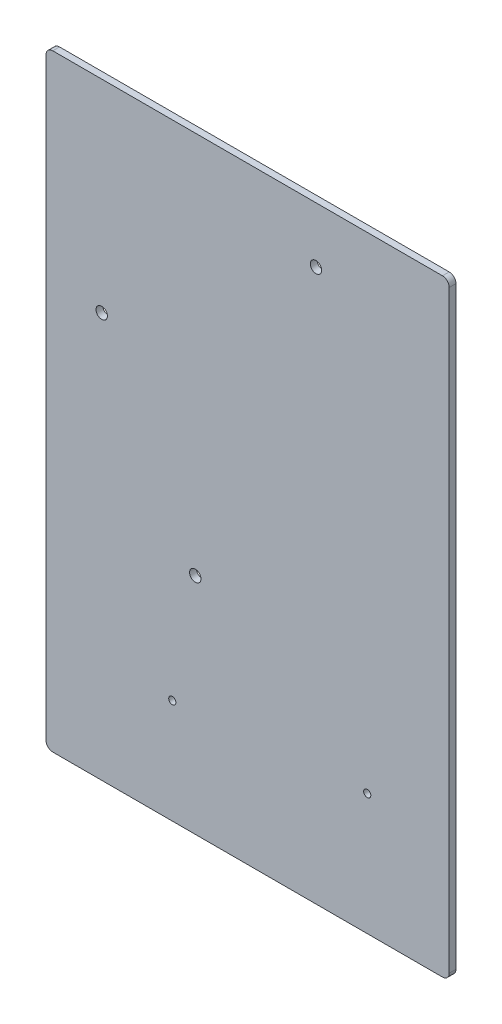
ISO-10303-21;
HEADER;
FILE_DESCRIPTION(('STEP AP214'),'2;1');
FILE_NAME('part.step','',(''),(''),'','','');
FILE_SCHEMA(('AUTOMOTIVE_DESIGN { 1 0 10303 214 1 1 1 1 }'));
ENDSEC;
DATA;
#1=APPLICATION_CONTEXT('core data for automotive mechanical design processes');
#2=APPLICATION_PROTOCOL_DEFINITION('international standard','automotive_design',2000,#1);
#3=PRODUCT_CONTEXT('',#1,'mechanical');
#4=PRODUCT('Part','Part','',(#3));
#5=PRODUCT_RELATED_PRODUCT_CATEGORY('part','',(#4));
#6=PRODUCT_DEFINITION_FORMATION('','',#4);
#7=PRODUCT_DEFINITION_CONTEXT('part definition',#1,'design');
#8=PRODUCT_DEFINITION('design','',#6,#7);
#9=PRODUCT_DEFINITION_SHAPE('','',#8);
#10=(LENGTH_UNIT() NAMED_UNIT(*) SI_UNIT(.MILLI.,.METRE.));
#11=(NAMED_UNIT(*) PLANE_ANGLE_UNIT() SI_UNIT($,.RADIAN.));
#12=(NAMED_UNIT(*) SI_UNIT($,.STERADIAN.) SOLID_ANGLE_UNIT());
#13=UNCERTAINTY_MEASURE_WITH_UNIT(LENGTH_MEASURE(1.E-05),#10,'distance_accuracy_value','');
#14=(GEOMETRIC_REPRESENTATION_CONTEXT(3) GLOBAL_UNCERTAINTY_ASSIGNED_CONTEXT((#13)) GLOBAL_UNIT_ASSIGNED_CONTEXT((#10,
#11,#12)) REPRESENTATION_CONTEXT('',''));
#15=CARTESIAN_POINT('',(0.,0.,0.));
#16=DIRECTION('',(0.,0.,1.));
#17=DIRECTION('',(1.,0.,0.));
#18=AXIS2_PLACEMENT_3D('',#15,#16,#17);
#19=CARTESIAN_POINT('',(0.,0.,6.35));
#20=DIRECTION('',(0.,1.,0.));
#21=DIRECTION('',(0.,0.,1.));
#22=AXIS2_PLACEMENT_3D('',#19,#20,#21);
#23=PLANE('',#22);
#24=DIRECTION('',(1.,0.,0.));
#25=VECTOR('',#24,1.);
#26=CARTESIAN_POINT('',(0.,0.,0.));
#27=LINE('',#26,#25);
#28=CARTESIAN_POINT('',(6.35,0.,0.));
#29=VERTEX_POINT('',#28);
#30=CARTESIAN_POINT('',(373.0625,0.,0.));
#31=VERTEX_POINT('',#30);
#32=EDGE_CURVE('E188',#29,#31,#27,.T.);
#33=ORIENTED_EDGE('',*,*,#32,.T.);
#34=DIRECTION('',(0.,0.,-1.));
#35=VECTOR('',#34,1.);
#36=CARTESIAN_POINT('',(373.0625,0.,6.35));
#37=LINE('',#36,#35);
#38=CARTESIAN_POINT('',(373.0625,0.,6.35));
#39=VERTEX_POINT('',#38);
#40=EDGE_CURVE('E157',#31,#39,#37,.F.);
#41=ORIENTED_EDGE('',*,*,#40,.T.);
#42=DIRECTION('',(1.,0.,0.));
#43=VECTOR('',#42,1.);
#44=CARTESIAN_POINT('',(0.,0.,6.35));
#45=LINE('',#44,#43);
#46=CARTESIAN_POINT('',(6.35,0.,6.35));
#47=VERTEX_POINT('',#46);
#48=EDGE_CURVE('E119',#47,#39,#45,.T.);
#49=ORIENTED_EDGE('',*,*,#48,.F.);
#50=DIRECTION('',(0.,0.,-1.));
#51=VECTOR('',#50,1.);
#52=CARTESIAN_POINT('',(6.35,0.,6.35));
#53=LINE('',#52,#51);
#54=EDGE_CURVE('E153',#47,#29,#53,.T.);
#55=ORIENTED_EDGE('',*,*,#54,.T.);
#56=EDGE_LOOP('',(#33,#41,#49,#55));
#57=FACE_BOUND('',#56,.T.);
#58=ADVANCED_FACE('F38',(#57),#23,.F.);
#59=CARTESIAN_POINT('',(379.4125,571.5,6.35));
#60=DIRECTION('',(-1.,0.,0.));
#61=DIRECTION('',(0.,0.,1.));
#62=AXIS2_PLACEMENT_3D('',#59,#60,#61);
#63=PLANE('',#62);
#64=DIRECTION('',(0.,1.,0.));
#65=VECTOR('',#64,1.);
#66=CARTESIAN_POINT('',(379.4125,0.,6.35));
#67=LINE('',#66,#65);
#68=CARTESIAN_POINT('',(379.4125,6.34999999999997,6.35));
#69=VERTEX_POINT('',#68);
#70=CARTESIAN_POINT('',(379.4125,565.15,6.35));
#71=VERTEX_POINT('',#70);
#72=EDGE_CURVE('E116',#69,#71,#67,.T.);
#73=ORIENTED_EDGE('',*,*,#72,.F.);
#74=DIRECTION('',(0.,0.,-1.));
#75=VECTOR('',#74,1.);
#76=CARTESIAN_POINT('',(379.4125,6.34999999999997,6.35));
#77=LINE('',#76,#75);
#78=CARTESIAN_POINT('',(379.4125,6.34999999999997,0.));
#79=VERTEX_POINT('',#78);
#80=EDGE_CURVE('E129',#69,#79,#77,.T.);
#81=ORIENTED_EDGE('',*,*,#80,.T.);
#82=DIRECTION('',(0.,1.,0.));
#83=VECTOR('',#82,1.);
#84=CARTESIAN_POINT('',(379.4125,0.,0.));
#85=LINE('',#84,#83);
#86=CARTESIAN_POINT('',(379.4125,565.15,0.));
#87=VERTEX_POINT('',#86);
#88=EDGE_CURVE('E184',#79,#87,#85,.T.);
#89=ORIENTED_EDGE('',*,*,#88,.T.);
#90=DIRECTION('',(0.,0.,-1.));
#91=VECTOR('',#90,1.);
#92=CARTESIAN_POINT('',(379.4125,565.15,6.35));
#93=LINE('',#92,#91);
#94=EDGE_CURVE('E132',#87,#71,#93,.F.);
#95=ORIENTED_EDGE('',*,*,#94,.T.);
#96=EDGE_LOOP('',(#73,#81,#89,#95));
#97=FACE_BOUND('',#96,.T.);
#98=ADVANCED_FACE('F127',(#97),#63,.F.);
#99=CARTESIAN_POINT('',(379.4125,571.5,6.35));
#100=DIRECTION('',(0.,-1.,0.));
#101=DIRECTION('',(0.,0.,-1.));
#102=AXIS2_PLACEMENT_3D('',#99,#100,#101);
#103=PLANE('',#102);
#104=DIRECTION('',(-1.,0.,0.));
#105=VECTOR('',#104,1.);
#106=CARTESIAN_POINT('',(379.4125,571.5,0.));
#107=LINE('',#106,#105);
#108=CARTESIAN_POINT('',(373.0625,571.5,0.));
#109=VERTEX_POINT('',#108);
#110=CARTESIAN_POINT('',(6.35000000000002,571.5,0.));
#111=VERTEX_POINT('',#110);
#112=EDGE_CURVE('E177',#109,#111,#107,.T.);
#113=ORIENTED_EDGE('',*,*,#112,.T.);
#114=DIRECTION('',(0.,0.,-1.));
#115=VECTOR('',#114,1.);
#116=CARTESIAN_POINT('',(6.35000000000002,571.5,6.35));
#117=LINE('',#116,#115);
#118=CARTESIAN_POINT('',(6.35000000000002,571.5,6.35));
#119=VERTEX_POINT('',#118);
#120=EDGE_CURVE('E11',#111,#119,#117,.F.);
#121=ORIENTED_EDGE('',*,*,#120,.T.);
#122=DIRECTION('',(-1.,0.,0.));
#123=VECTOR('',#122,1.);
#124=CARTESIAN_POINT('',(379.4125,571.5,6.35));
#125=LINE('',#124,#123);
#126=CARTESIAN_POINT('',(373.0625,571.5,6.35));
#127=VERTEX_POINT('',#126);
#128=EDGE_CURVE('E134',#127,#119,#125,.T.);
#129=ORIENTED_EDGE('',*,*,#128,.F.);
#130=DIRECTION('',(0.,0.,-1.));
#131=VECTOR('',#130,1.);
#132=CARTESIAN_POINT('',(373.0625,571.5,6.35));
#133=LINE('',#132,#131);
#134=EDGE_CURVE('E46',#127,#109,#133,.T.);
#135=ORIENTED_EDGE('',*,*,#134,.T.);
#136=EDGE_LOOP('',(#113,#121,#129,#135));
#137=FACE_BOUND('',#136,.T.);
#138=ADVANCED_FACE('F176',(#137),#103,.F.);
#139=CARTESIAN_POINT('',(0.,0.,6.35));
#140=DIRECTION('',(1.,0.,0.));
#141=DIRECTION('',(0.,0.,-1.));
#142=AXIS2_PLACEMENT_3D('',#139,#140,#141);
#143=PLANE('',#142);
#144=DIRECTION('',(0.,-1.,0.));
#145=VECTOR('',#144,1.);
#146=CARTESIAN_POINT('',(0.,0.,6.35));
#147=LINE('',#146,#145);
#148=CARTESIAN_POINT('',(0.,565.15,6.35));
#149=VERTEX_POINT('',#148);
#150=CARTESIAN_POINT('',(0.,6.35,6.35));
#151=VERTEX_POINT('',#150);
#152=EDGE_CURVE('E145',#149,#151,#147,.T.);
#153=ORIENTED_EDGE('',*,*,#152,.F.);
#154=DIRECTION('',(0.,0.,-1.));
#155=VECTOR('',#154,1.);
#156=CARTESIAN_POINT('',(0.,565.15,6.35));
#157=LINE('',#156,#155);
#158=CARTESIAN_POINT('',(0.,565.15,0.));
#159=VERTEX_POINT('',#158);
#160=EDGE_CURVE('E168',#149,#159,#157,.T.);
#161=ORIENTED_EDGE('',*,*,#160,.T.);
#162=DIRECTION('',(0.,-1.,0.));
#163=VECTOR('',#162,1.);
#164=CARTESIAN_POINT('',(0.,0.,0.));
#165=LINE('',#164,#163);
#166=CARTESIAN_POINT('',(0.,6.35,0.));
#167=VERTEX_POINT('',#166);
#168=EDGE_CURVE('E183',#159,#167,#165,.T.);
#169=ORIENTED_EDGE('',*,*,#168,.T.);
#170=DIRECTION('',(0.,0.,-1.));
#171=VECTOR('',#170,1.);
#172=CARTESIAN_POINT('',(0.,6.35,6.35));
#173=LINE('',#172,#171);
#174=EDGE_CURVE('E56',#167,#151,#173,.F.);
#175=ORIENTED_EDGE('',*,*,#174,.T.);
#176=EDGE_LOOP('',(#153,#161,#169,#175));
#177=FACE_BOUND('',#176,.T.);
#178=ADVANCED_FACE('F287',(#177),#143,.F.);
#179=CARTESIAN_POINT('',(0.,0.,6.35));
#180=DIRECTION('',(0.,0.,1.));
#181=DIRECTION('',(1.,0.,0.));
#182=AXIS2_PLACEMENT_3D('',#179,#180,#181);
#183=PLANE('',#182);
#184=CARTESIAN_POINT('',(254.,519.1125,6.35));
#185=DIRECTION('',(0.,0.,-1.));
#186=DIRECTION('',(-1.,0.,0.));
#187=AXIS2_PLACEMENT_3D('',#184,#185,#186);
#188=CIRCLE('',#187,5.35787599999998);
#189=CARTESIAN_POINT('',(248.642124,519.1125,6.35));
#190=VERTEX_POINT('',#189);
#191=EDGE_CURVE('E231',#190,#190,#188,.T.);
#192=ORIENTED_EDGE('',*,*,#191,.T.);
#193=EDGE_LOOP('',(#192));
#194=FACE_BOUND('',#193,.T.);
#195=CARTESIAN_POINT('',(52.3875,381.,6.35));
#196=DIRECTION('',(0.,0.,-1.));
#197=DIRECTION('',(-1.,0.,0.));
#198=AXIS2_PLACEMENT_3D('',#195,#196,#197);
#199=CIRCLE('',#198,5.357876);
#200=CARTESIAN_POINT('',(47.029624,381.,6.35));
#201=VERTEX_POINT('',#200);
#202=EDGE_CURVE('E223',#201,#201,#199,.T.);
#203=ORIENTED_EDGE('',*,*,#202,.T.);
#204=EDGE_LOOP('',(#203));
#205=FACE_BOUND('',#204,.T.);
#206=CARTESIAN_POINT('',(140.462,210.82,6.35));
#207=DIRECTION('',(0.,0.,-1.));
#208=DIRECTION('',(-1.,0.,0.));
#209=AXIS2_PLACEMENT_3D('',#206,#207,#208);
#210=CIRCLE('',#209,5.35787600000001);
#211=CARTESIAN_POINT('',(135.104124,210.82,6.35));
#212=VERTEX_POINT('',#211);
#213=EDGE_CURVE('E215',#212,#212,#210,.T.);
#214=ORIENTED_EDGE('',*,*,#213,.T.);
#215=EDGE_LOOP('',(#214));
#216=FACE_BOUND('',#215,.T.);
#217=ORIENTED_EDGE('',*,*,#48,.T.);
#218=CARTESIAN_POINT('',(373.0625,6.34999999999997,6.35));
#219=DIRECTION('',(0.,0.,1.));
#220=DIRECTION('',(1.,0.,0.));
#221=AXIS2_PLACEMENT_3D('',#218,#219,#220);
#222=CIRCLE('',#221,6.35);
#223=EDGE_CURVE('E112',#39,#69,#222,.T.);
#224=ORIENTED_EDGE('',*,*,#223,.T.);
#225=ORIENTED_EDGE('',*,*,#72,.T.);
#226=CARTESIAN_POINT('',(373.0625,565.15,6.35));
#227=DIRECTION('',(0.,0.,1.));
#228=DIRECTION('',(1.,0.,0.));
#229=AXIS2_PLACEMENT_3D('',#226,#227,#228);
#230=CIRCLE('',#229,6.35);
#231=EDGE_CURVE('E163',#71,#127,#230,.T.);
#232=ORIENTED_EDGE('',*,*,#231,.T.);
#233=ORIENTED_EDGE('',*,*,#128,.T.);
#234=CARTESIAN_POINT('',(6.35,565.15,6.35));
#235=DIRECTION('',(0.,0.,1.));
#236=DIRECTION('',(1.,0.,0.));
#237=AXIS2_PLACEMENT_3D('',#234,#235,#236);
#238=CIRCLE('',#237,6.35);
#239=EDGE_CURVE('E63',#119,#149,#238,.T.);
#240=ORIENTED_EDGE('',*,*,#239,.T.);
#241=ORIENTED_EDGE('',*,*,#152,.T.);
#242=CARTESIAN_POINT('',(6.35,6.35,6.35));
#243=DIRECTION('',(0.,0.,1.));
#244=DIRECTION('',(1.,0.,0.));
#245=AXIS2_PLACEMENT_3D('',#242,#243,#244);
#246=CIRCLE('',#245,6.35);
#247=EDGE_CURVE('E160',#151,#47,#246,.T.);
#248=ORIENTED_EDGE('',*,*,#247,.T.);
#249=EDGE_LOOP('',(#217,#224,#225,#232,#233,#240,#241,#248));
#250=FACE_BOUND('',#249,.T.);
#251=CARTESIAN_POINT('',(118.810746346405,98.25026997302,6.35));
#252=DIRECTION('',(0.,0.,-1.));
#253=DIRECTION('',(-1.,0.,0.));
#254=AXIS2_PLACEMENT_3D('',#251,#252,#253);
#255=CIRCLE('',#254,3.3782);
#256=CARTESIAN_POINT('',(115.432546346405,98.25026997302,6.35));
#257=VERTEX_POINT('',#256);
#258=EDGE_CURVE('E207',#257,#257,#255,.T.);
#259=ORIENTED_EDGE('',*,*,#258,.T.);
#260=EDGE_LOOP('',(#259));
#261=FACE_BOUND('',#260,.T.);
#262=CARTESIAN_POINT('',(302.26,114.3,6.35));
#263=DIRECTION('',(0.,0.,-1.));
#264=DIRECTION('',(-1.,0.,0.));
#265=AXIS2_PLACEMENT_3D('',#262,#263,#264);
#266=CIRCLE('',#265,3.3782);
#267=CARTESIAN_POINT('',(298.8818,114.3,6.35));
#268=VERTEX_POINT('',#267);
#269=EDGE_CURVE('E194',#268,#268,#266,.T.);
#270=ORIENTED_EDGE('',*,*,#269,.T.);
#271=EDGE_LOOP('',(#270));
#272=FACE_BOUND('',#271,.T.);
#273=ADVANCED_FACE('F114',(#194,#205,#216,#250,#261,#272),#183,.T.);
#274=CARTESIAN_POINT('',(0.,0.,0.));
#275=DIRECTION('',(0.,0.,1.));
#276=DIRECTION('',(1.,0.,0.));
#277=AXIS2_PLACEMENT_3D('',#274,#275,#276);
#278=PLANE('',#277);
#279=CARTESIAN_POINT('',(254.,519.1125,0.));
#280=DIRECTION('',(0.,0.,-1.));
#281=DIRECTION('',(-1.,0.,0.));
#282=AXIS2_PLACEMENT_3D('',#279,#280,#281);
#283=CIRCLE('',#282,5.35787599999998);
#284=CARTESIAN_POINT('',(248.642124,519.1125,0.));
#285=VERTEX_POINT('',#284);
#286=EDGE_CURVE('E235',#285,#285,#283,.T.);
#287=ORIENTED_EDGE('',*,*,#286,.F.);
#288=EDGE_LOOP('',(#287));
#289=FACE_BOUND('',#288,.T.);
#290=CARTESIAN_POINT('',(52.3875,381.,0.));
#291=DIRECTION('',(0.,0.,-1.));
#292=DIRECTION('',(-1.,0.,0.));
#293=AXIS2_PLACEMENT_3D('',#290,#291,#292);
#294=CIRCLE('',#293,5.357876);
#295=CARTESIAN_POINT('',(47.029624,381.,0.));
#296=VERTEX_POINT('',#295);
#297=EDGE_CURVE('E227',#296,#296,#294,.T.);
#298=ORIENTED_EDGE('',*,*,#297,.F.);
#299=EDGE_LOOP('',(#298));
#300=FACE_BOUND('',#299,.T.);
#301=CARTESIAN_POINT('',(140.462,210.82,0.));
#302=DIRECTION('',(0.,0.,-1.));
#303=DIRECTION('',(-1.,0.,0.));
#304=AXIS2_PLACEMENT_3D('',#301,#302,#303);
#305=CIRCLE('',#304,5.35787600000001);
#306=CARTESIAN_POINT('',(135.104124,210.82,0.));
#307=VERTEX_POINT('',#306);
#308=EDGE_CURVE('E219',#307,#307,#305,.T.);
#309=ORIENTED_EDGE('',*,*,#308,.F.);
#310=EDGE_LOOP('',(#309));
#311=FACE_BOUND('',#310,.T.);
#312=CARTESIAN_POINT('',(118.810746346405,98.25026997302,0.));
#313=DIRECTION('',(0.,0.,-1.));
#314=DIRECTION('',(-1.,0.,0.));
#315=AXIS2_PLACEMENT_3D('',#312,#313,#314);
#316=CIRCLE('',#315,3.37819999999998);
#317=CARTESIAN_POINT('',(115.432546346405,98.25026997302,0.));
#318=VERTEX_POINT('',#317);
#319=EDGE_CURVE('E211',#318,#318,#316,.T.);
#320=ORIENTED_EDGE('',*,*,#319,.F.);
#321=EDGE_LOOP('',(#320));
#322=FACE_BOUND('',#321,.T.);
#323=CARTESIAN_POINT('',(302.26,114.3,0.));
#324=DIRECTION('',(0.,0.,-1.));
#325=DIRECTION('',(-1.,0.,0.));
#326=AXIS2_PLACEMENT_3D('',#323,#324,#325);
#327=CIRCLE('',#326,3.3782);
#328=CARTESIAN_POINT('',(298.8818,114.3,0.));
#329=VERTEX_POINT('',#328);
#330=EDGE_CURVE('E203',#329,#329,#327,.T.);
#331=ORIENTED_EDGE('',*,*,#330,.F.);
#332=EDGE_LOOP('',(#331));
#333=FACE_BOUND('',#332,.T.);
#334=ORIENTED_EDGE('',*,*,#88,.F.);
#335=CARTESIAN_POINT('',(373.0625,6.34999999999997,0.));
#336=DIRECTION('',(0.,0.,1.));
#337=DIRECTION('',(1.,0.,0.));
#338=AXIS2_PLACEMENT_3D('',#335,#336,#337);
#339=CIRCLE('',#338,6.35);
#340=EDGE_CURVE('E137',#79,#31,#339,.F.);
#341=ORIENTED_EDGE('',*,*,#340,.T.);
#342=ORIENTED_EDGE('',*,*,#32,.F.);
#343=CARTESIAN_POINT('',(6.35,6.35,0.));
#344=DIRECTION('',(0.,0.,1.));
#345=DIRECTION('',(1.,0.,0.));
#346=AXIS2_PLACEMENT_3D('',#343,#344,#345);
#347=CIRCLE('',#346,6.35);
#348=EDGE_CURVE('E139',#29,#167,#347,.F.);
#349=ORIENTED_EDGE('',*,*,#348,.T.);
#350=ORIENTED_EDGE('',*,*,#168,.F.);
#351=CARTESIAN_POINT('',(6.35,565.15,0.));
#352=DIRECTION('',(0.,0.,1.));
#353=DIRECTION('',(1.,0.,0.));
#354=AXIS2_PLACEMENT_3D('',#351,#352,#353);
#355=CIRCLE('',#354,6.35);
#356=EDGE_CURVE('E150',#159,#111,#355,.F.);
#357=ORIENTED_EDGE('',*,*,#356,.T.);
#358=ORIENTED_EDGE('',*,*,#112,.F.);
#359=CARTESIAN_POINT('',(373.0625,565.15,0.));
#360=DIRECTION('',(0.,0.,1.));
#361=DIRECTION('',(1.,0.,0.));
#362=AXIS2_PLACEMENT_3D('',#359,#360,#361);
#363=CIRCLE('',#362,6.35);
#364=EDGE_CURVE('E143',#109,#87,#363,.F.);
#365=ORIENTED_EDGE('',*,*,#364,.T.);
#366=EDGE_LOOP('',(#334,#341,#342,#349,#350,#357,#358,#365));
#367=FACE_BOUND('',#366,.T.);
#368=ADVANCED_FACE('F181',(#289,#300,#311,#322,#333,#367),#278,.F.);
#369=CARTESIAN_POINT('',(302.26,114.3,0.));
#370=DIRECTION('',(0.,0.,-1.));
#371=DIRECTION('',(-1.,0.,0.));
#372=AXIS2_PLACEMENT_3D('',#369,#370,#371);
#373=CYLINDRICAL_SURFACE('',#372,3.3782);
#374=ORIENTED_EDGE('',*,*,#269,.F.);
#375=EDGE_LOOP('',(#374));
#376=FACE_BOUND('',#375,.T.);
#377=ORIENTED_EDGE('',*,*,#330,.T.);
#378=EDGE_LOOP('',(#377));
#379=FACE_BOUND('',#378,.T.);
#380=ADVANCED_FACE('F244',(#376,#379),#373,.F.);
#381=CARTESIAN_POINT('',(118.810746346405,98.25026997302,0.));
#382=DIRECTION('',(0.,0.,-1.));
#383=DIRECTION('',(-1.,0.,0.));
#384=AXIS2_PLACEMENT_3D('',#381,#382,#383);
#385=CYLINDRICAL_SURFACE('',#384,3.37819999999999);
#386=ORIENTED_EDGE('',*,*,#258,.F.);
#387=EDGE_LOOP('',(#386));
#388=FACE_BOUND('',#387,.T.);
#389=ORIENTED_EDGE('',*,*,#319,.T.);
#390=EDGE_LOOP('',(#389));
#391=FACE_BOUND('',#390,.T.);
#392=ADVANCED_FACE('F255',(#388,#391),#385,.F.);
#393=CARTESIAN_POINT('',(140.462,210.82,0.));
#394=DIRECTION('',(0.,0.,-1.));
#395=DIRECTION('',(-1.,0.,0.));
#396=AXIS2_PLACEMENT_3D('',#393,#394,#395);
#397=CYLINDRICAL_SURFACE('',#396,5.35787600000001);
#398=ORIENTED_EDGE('',*,*,#213,.F.);
#399=EDGE_LOOP('',(#398));
#400=FACE_BOUND('',#399,.T.);
#401=ORIENTED_EDGE('',*,*,#308,.T.);
#402=EDGE_LOOP('',(#401));
#403=FACE_BOUND('',#402,.T.);
#404=ADVANCED_FACE('F261',(#400,#403),#397,.F.);
#405=CARTESIAN_POINT('',(52.3875,381.,0.));
#406=DIRECTION('',(0.,0.,-1.));
#407=DIRECTION('',(-1.,0.,0.));
#408=AXIS2_PLACEMENT_3D('',#405,#406,#407);
#409=CYLINDRICAL_SURFACE('',#408,5.357876);
#410=ORIENTED_EDGE('',*,*,#202,.F.);
#411=EDGE_LOOP('',(#410));
#412=FACE_BOUND('',#411,.T.);
#413=ORIENTED_EDGE('',*,*,#297,.T.);
#414=EDGE_LOOP('',(#413));
#415=FACE_BOUND('',#414,.T.);
#416=ADVANCED_FACE('F320',(#412,#415),#409,.F.);
#417=CARTESIAN_POINT('',(254.,519.1125,0.));
#418=DIRECTION('',(0.,0.,-1.));
#419=DIRECTION('',(-1.,0.,0.));
#420=AXIS2_PLACEMENT_3D('',#417,#418,#419);
#421=CYLINDRICAL_SURFACE('',#420,5.35787599999998);
#422=ORIENTED_EDGE('',*,*,#191,.F.);
#423=EDGE_LOOP('',(#422));
#424=FACE_BOUND('',#423,.T.);
#425=ORIENTED_EDGE('',*,*,#286,.T.);
#426=EDGE_LOOP('',(#425));
#427=FACE_BOUND('',#426,.T.);
#428=ADVANCED_FACE('F240',(#424,#427),#421,.F.);
#429=CARTESIAN_POINT('',(373.0625,6.34999999999997,6.35));
#430=DIRECTION('',(0.,0.,-1.));
#431=DIRECTION('',(-1.,0.,0.));
#432=AXIS2_PLACEMENT_3D('',#429,#430,#431);
#433=CYLINDRICAL_SURFACE('',#432,6.35);
#434=ORIENTED_EDGE('',*,*,#223,.F.);
#435=ORIENTED_EDGE('',*,*,#40,.F.);
#436=ORIENTED_EDGE('',*,*,#340,.F.);
#437=ORIENTED_EDGE('',*,*,#80,.F.);
#438=EDGE_LOOP('',(#434,#435,#436,#437));
#439=FACE_BOUND('',#438,.T.);
#440=ADVANCED_FACE('F136',(#439),#433,.T.);
#441=CARTESIAN_POINT('',(6.35,565.15,6.35));
#442=DIRECTION('',(0.,0.,-1.));
#443=DIRECTION('',(-1.,0.,0.));
#444=AXIS2_PLACEMENT_3D('',#441,#442,#443);
#445=CYLINDRICAL_SURFACE('',#444,6.35);
#446=ORIENTED_EDGE('',*,*,#239,.F.);
#447=ORIENTED_EDGE('',*,*,#120,.F.);
#448=ORIENTED_EDGE('',*,*,#356,.F.);
#449=ORIENTED_EDGE('',*,*,#160,.F.);
#450=EDGE_LOOP('',(#446,#447,#448,#449));
#451=FACE_BOUND('',#450,.T.);
#452=ADVANCED_FACE('F277',(#451),#445,.T.);
#453=CARTESIAN_POINT('',(373.0625,565.15,6.35));
#454=DIRECTION('',(0.,0.,-1.));
#455=DIRECTION('',(-1.,0.,0.));
#456=AXIS2_PLACEMENT_3D('',#453,#454,#455);
#457=CYLINDRICAL_SURFACE('',#456,6.35);
#458=ORIENTED_EDGE('',*,*,#231,.F.);
#459=ORIENTED_EDGE('',*,*,#94,.F.);
#460=ORIENTED_EDGE('',*,*,#364,.F.);
#461=ORIENTED_EDGE('',*,*,#134,.F.);
#462=EDGE_LOOP('',(#458,#459,#460,#461));
#463=FACE_BOUND('',#462,.T.);
#464=ADVANCED_FACE('F279',(#463),#457,.T.);
#465=CARTESIAN_POINT('',(6.35,6.35,6.35));
#466=DIRECTION('',(0.,0.,-1.));
#467=DIRECTION('',(-1.,0.,0.));
#468=AXIS2_PLACEMENT_3D('',#465,#466,#467);
#469=CYLINDRICAL_SURFACE('',#468,6.35);
#470=ORIENTED_EDGE('',*,*,#247,.F.);
#471=ORIENTED_EDGE('',*,*,#174,.F.);
#472=ORIENTED_EDGE('',*,*,#348,.F.);
#473=ORIENTED_EDGE('',*,*,#54,.F.);
#474=EDGE_LOOP('',(#470,#471,#472,#473));
#475=FACE_BOUND('',#474,.T.);
#476=ADVANCED_FACE('F40',(#475),#469,.T.);
#477=CLOSED_SHELL('',(#58,#98,#138,#178,#273,#368,#380,#392,#404,#416,#428,#440,#452,#464,#476));
#478=MANIFOLD_SOLID_BREP('B2',#477);
#479=ADVANCED_BREP_SHAPE_REPRESENTATION('',(#18,#478),#14);
#480=SHAPE_DEFINITION_REPRESENTATION(#9,#479);
ENDSEC;
END-ISO-10303-21;
